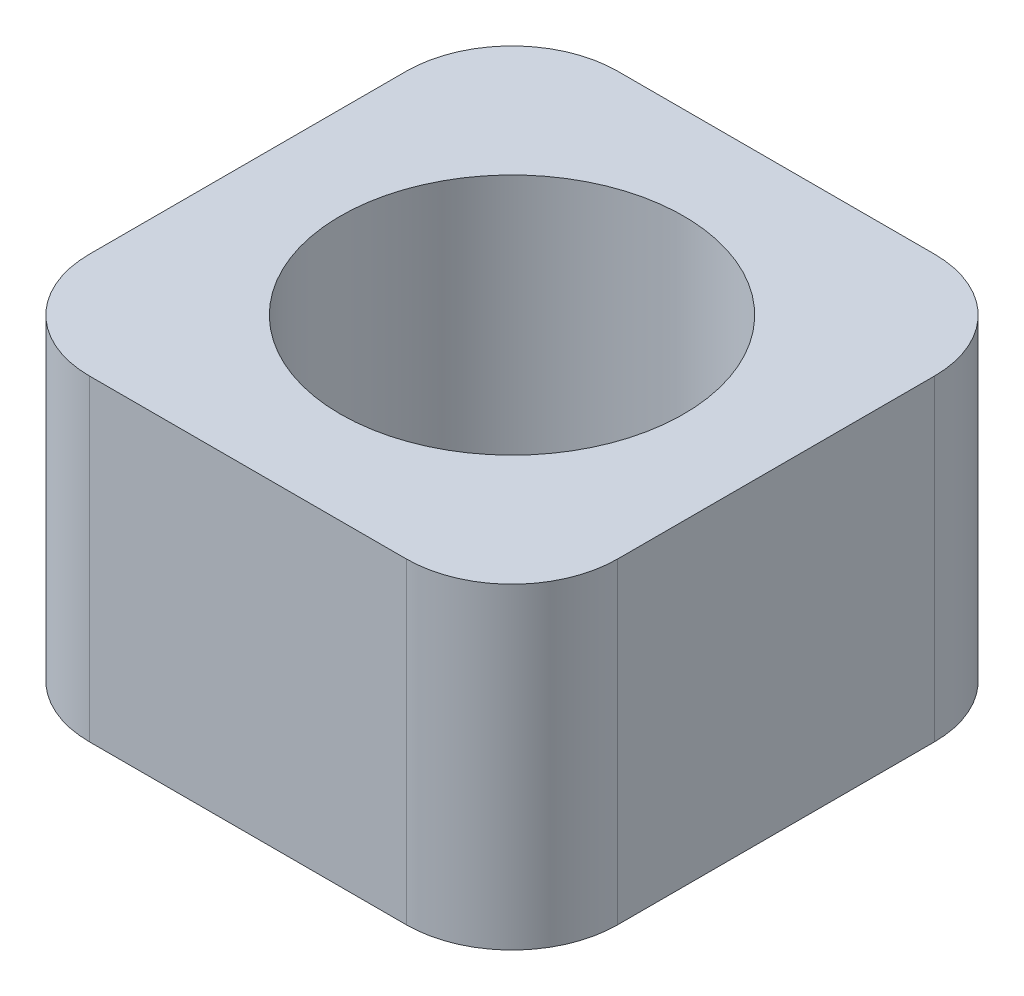
ISO-10303-21;
HEADER;
FILE_DESCRIPTION(('STEP AP214'),'2;1');
FILE_NAME('part.step','',(''),(''),'','','');
FILE_SCHEMA(('AUTOMOTIVE_DESIGN { 1 0 10303 214 1 1 1 1 }'));
ENDSEC;
DATA;
#1=APPLICATION_CONTEXT('core data for automotive mechanical design processes');
#2=APPLICATION_PROTOCOL_DEFINITION('international standard','automotive_design',2000,#1);
#3=PRODUCT_CONTEXT('',#1,'mechanical');
#4=PRODUCT('Part','Part','',(#3));
#5=PRODUCT_RELATED_PRODUCT_CATEGORY('part','',(#4));
#6=PRODUCT_DEFINITION_FORMATION('','',#4);
#7=PRODUCT_DEFINITION_CONTEXT('part definition',#1,'design');
#8=PRODUCT_DEFINITION('design','',#6,#7);
#9=PRODUCT_DEFINITION_SHAPE('','',#8);
#10=(LENGTH_UNIT() NAMED_UNIT(*) SI_UNIT(.MILLI.,.METRE.));
#11=(NAMED_UNIT(*) PLANE_ANGLE_UNIT() SI_UNIT($,.RADIAN.));
#12=(NAMED_UNIT(*) SI_UNIT($,.STERADIAN.) SOLID_ANGLE_UNIT());
#13=UNCERTAINTY_MEASURE_WITH_UNIT(LENGTH_MEASURE(1.E-05),#10,'distance_accuracy_value','');
#14=(GEOMETRIC_REPRESENTATION_CONTEXT(3) GLOBAL_UNCERTAINTY_ASSIGNED_CONTEXT((#13)) GLOBAL_UNIT_ASSIGNED_CONTEXT((#10,
#11,#12)) REPRESENTATION_CONTEXT('',''));
#15=CARTESIAN_POINT('',(0.,0.,0.));
#16=DIRECTION('',(0.,0.,1.));
#17=DIRECTION('',(1.,0.,0.));
#18=AXIS2_PLACEMENT_3D('',#15,#16,#17);
#19=CARTESIAN_POINT('',(-5.,3.,0.));
#20=DIRECTION('',(-1.,0.,0.));
#21=DIRECTION('',(0.,0.,1.));
#22=AXIS2_PLACEMENT_3D('',#19,#20,#21);
#23=PLANE('',#22);
#24=DIRECTION('',(0.,0.,-1.));
#25=VECTOR('',#24,1.);
#26=CARTESIAN_POINT('',(-5.,-3.,0.));
#27=LINE('',#26,#25);
#28=CARTESIAN_POINT('',(-5.,-3.,3.));
#29=VERTEX_POINT('',#28);
#30=CARTESIAN_POINT('',(-5.,-3.,-3.));
#31=VERTEX_POINT('',#30);
#32=EDGE_CURVE('E111',#29,#31,#27,.T.);
#33=ORIENTED_EDGE('',*,*,#32,.F.);
#34=DIRECTION('',(0.,-1.,0.));
#35=VECTOR('',#34,1.);
#36=CARTESIAN_POINT('',(-5.,3.,3.));
#37=LINE('',#36,#35);
#38=CARTESIAN_POINT('',(-5.,3.,3.));
#39=VERTEX_POINT('',#38);
#40=EDGE_CURVE('E11',#29,#39,#37,.F.);
#41=ORIENTED_EDGE('',*,*,#40,.T.);
#42=DIRECTION('',(0.,0.,-1.));
#43=VECTOR('',#42,1.);
#44=CARTESIAN_POINT('',(-5.,3.,0.));
#45=LINE('',#44,#43);
#46=CARTESIAN_POINT('',(-5.,3.,-3.));
#47=VERTEX_POINT('',#46);
#48=EDGE_CURVE('E161',#39,#47,#45,.T.);
#49=ORIENTED_EDGE('',*,*,#48,.T.);
#50=DIRECTION('',(0.,-1.,0.));
#51=VECTOR('',#50,1.);
#52=CARTESIAN_POINT('',(-5.,3.,-3.));
#53=LINE('',#52,#51);
#54=EDGE_CURVE('E47',#47,#31,#53,.T.);
#55=ORIENTED_EDGE('',*,*,#54,.T.);
#56=EDGE_LOOP('',(#33,#41,#49,#55));
#57=FACE_BOUND('',#56,.T.);
#58=ADVANCED_FACE('F39',(#57),#23,.T.);
#59=CARTESIAN_POINT('',(0.,3.,5.));
#60=DIRECTION('',(0.,0.,-1.));
#61=DIRECTION('',(-1.,0.,0.));
#62=AXIS2_PLACEMENT_3D('',#59,#60,#61);
#63=PLANE('',#62);
#64=DIRECTION('',(1.,0.,0.));
#65=VECTOR('',#64,1.);
#66=CARTESIAN_POINT('',(0.,-3.,5.));
#67=LINE('',#66,#65);
#68=CARTESIAN_POINT('',(-3.,-3.,5.));
#69=VERTEX_POINT('',#68);
#70=CARTESIAN_POINT('',(3.,-3.,5.));
#71=VERTEX_POINT('',#70);
#72=EDGE_CURVE('E172',#69,#71,#67,.T.);
#73=ORIENTED_EDGE('',*,*,#72,.T.);
#74=DIRECTION('',(0.,-1.,0.));
#75=VECTOR('',#74,1.);
#76=CARTESIAN_POINT('',(3.,3.,5.));
#77=LINE('',#76,#75);
#78=CARTESIAN_POINT('',(3.,3.,5.));
#79=VERTEX_POINT('',#78);
#80=EDGE_CURVE('E54',#71,#79,#77,.F.);
#81=ORIENTED_EDGE('',*,*,#80,.T.);
#82=DIRECTION('',(1.,0.,0.));
#83=VECTOR('',#82,1.);
#84=CARTESIAN_POINT('',(0.,3.,5.));
#85=LINE('',#84,#83);
#86=CARTESIAN_POINT('',(-3.,3.,5.));
#87=VERTEX_POINT('',#86);
#88=EDGE_CURVE('E162',#87,#79,#85,.T.);
#89=ORIENTED_EDGE('',*,*,#88,.F.);
#90=DIRECTION('',(0.,-1.,0.));
#91=VECTOR('',#90,1.);
#92=CARTESIAN_POINT('',(-3.,-3.,5.));
#93=LINE('',#92,#91);
#94=EDGE_CURVE('E155',#87,#69,#93,.T.);
#95=ORIENTED_EDGE('',*,*,#94,.T.);
#96=EDGE_LOOP('',(#73,#81,#89,#95));
#97=FACE_BOUND('',#96,.T.);
#98=ADVANCED_FACE('F190',(#97),#63,.F.);
#99=CARTESIAN_POINT('',(5.,3.,0.));
#100=DIRECTION('',(-1.,0.,0.));
#101=DIRECTION('',(0.,0.,1.));
#102=AXIS2_PLACEMENT_3D('',#99,#100,#101);
#103=PLANE('',#102);
#104=DIRECTION('',(0.,0.,-1.));
#105=VECTOR('',#104,1.);
#106=CARTESIAN_POINT('',(5.,-3.,0.));
#107=LINE('',#106,#105);
#108=CARTESIAN_POINT('',(5.,-3.,3.));
#109=VERTEX_POINT('',#108);
#110=CARTESIAN_POINT('',(5.,-3.,-3.));
#111=VERTEX_POINT('',#110);
#112=EDGE_CURVE('E127',#109,#111,#107,.T.);
#113=ORIENTED_EDGE('',*,*,#112,.T.);
#114=DIRECTION('',(0.,-1.,0.));
#115=VECTOR('',#114,1.);
#116=CARTESIAN_POINT('',(5.,3.,-3.));
#117=LINE('',#116,#115);
#118=CARTESIAN_POINT('',(5.,3.,-3.));
#119=VERTEX_POINT('',#118);
#120=EDGE_CURVE('E147',#111,#119,#117,.F.);
#121=ORIENTED_EDGE('',*,*,#120,.T.);
#122=DIRECTION('',(0.,0.,-1.));
#123=VECTOR('',#122,1.);
#124=CARTESIAN_POINT('',(5.,3.,0.));
#125=LINE('',#124,#123);
#126=CARTESIAN_POINT('',(5.,3.,3.));
#127=VERTEX_POINT('',#126);
#128=EDGE_CURVE('E164',#127,#119,#125,.T.);
#129=ORIENTED_EDGE('',*,*,#128,.F.);
#130=DIRECTION('',(0.,-1.,0.));
#131=VECTOR('',#130,1.);
#132=CARTESIAN_POINT('',(5.,3.,3.));
#133=LINE('',#132,#131);
#134=EDGE_CURVE('E144',#127,#109,#133,.T.);
#135=ORIENTED_EDGE('',*,*,#134,.T.);
#136=EDGE_LOOP('',(#113,#121,#129,#135));
#137=FACE_BOUND('',#136,.T.);
#138=ADVANCED_FACE('F178',(#137),#103,.F.);
#139=CARTESIAN_POINT('',(0.,3.,-5.));
#140=DIRECTION('',(0.,0.,-1.));
#141=DIRECTION('',(-1.,0.,0.));
#142=AXIS2_PLACEMENT_3D('',#139,#140,#141);
#143=PLANE('',#142);
#144=DIRECTION('',(1.,0.,0.));
#145=VECTOR('',#144,1.);
#146=CARTESIAN_POINT('',(0.,3.,-5.));
#147=LINE('',#146,#145);
#148=CARTESIAN_POINT('',(-3.,3.,-5.));
#149=VERTEX_POINT('',#148);
#150=CARTESIAN_POINT('',(3.,3.,-5.));
#151=VERTEX_POINT('',#150);
#152=EDGE_CURVE('E135',#149,#151,#147,.T.);
#153=ORIENTED_EDGE('',*,*,#152,.T.);
#154=DIRECTION('',(0.,-1.,0.));
#155=VECTOR('',#154,1.);
#156=CARTESIAN_POINT('',(3.,-3.,-5.));
#157=LINE('',#156,#155);
#158=CARTESIAN_POINT('',(3.,-3.,-5.));
#159=VERTEX_POINT('',#158);
#160=EDGE_CURVE('E117',#151,#159,#157,.T.);
#161=ORIENTED_EDGE('',*,*,#160,.T.);
#162=DIRECTION('',(1.,0.,0.));
#163=VECTOR('',#162,1.);
#164=CARTESIAN_POINT('',(0.,-3.,-5.));
#165=LINE('',#164,#163);
#166=CARTESIAN_POINT('',(-3.,-3.,-5.));
#167=VERTEX_POINT('',#166);
#168=EDGE_CURVE('E109',#167,#159,#165,.T.);
#169=ORIENTED_EDGE('',*,*,#168,.F.);
#170=DIRECTION('',(0.,-1.,0.));
#171=VECTOR('',#170,1.);
#172=CARTESIAN_POINT('',(-3.,3.,-5.));
#173=LINE('',#172,#171);
#174=EDGE_CURVE('E123',#167,#149,#173,.F.);
#175=ORIENTED_EDGE('',*,*,#174,.T.);
#176=EDGE_LOOP('',(#153,#161,#169,#175));
#177=FACE_BOUND('',#176,.T.);
#178=ADVANCED_FACE('F122',(#177),#143,.T.);
#179=CARTESIAN_POINT('',(0.,3.,0.));
#180=DIRECTION('',(0.,-1.,0.));
#181=DIRECTION('',(0.,0.,-1.));
#182=AXIS2_PLACEMENT_3D('',#179,#180,#181);
#183=CYLINDRICAL_SURFACE('',#182,3.25);
#184=CARTESIAN_POINT('',(0.,3.,0.));
#185=DIRECTION('',(0.,1.,0.));
#186=DIRECTION('',(0.,0.,1.));
#187=AXIS2_PLACEMENT_3D('',#184,#185,#186);
#188=CIRCLE('',#187,3.25);
#189=CARTESIAN_POINT('',(0.,3.,3.25));
#190=VERTEX_POINT('',#189);
#191=EDGE_CURVE('E131',#190,#190,#188,.T.);
#192=ORIENTED_EDGE('',*,*,#191,.T.);
#193=EDGE_LOOP('',(#192));
#194=FACE_BOUND('',#193,.T.);
#195=CARTESIAN_POINT('',(0.,-3.,0.));
#196=DIRECTION('',(0.,1.,0.));
#197=DIRECTION('',(0.,0.,1.));
#198=AXIS2_PLACEMENT_3D('',#195,#196,#197);
#199=CIRCLE('',#198,3.25);
#200=CARTESIAN_POINT('',(0.,-3.,3.25));
#201=VERTEX_POINT('',#200);
#202=EDGE_CURVE('E126',#201,#201,#199,.T.);
#203=ORIENTED_EDGE('',*,*,#202,.F.);
#204=EDGE_LOOP('',(#203));
#205=FACE_BOUND('',#204,.T.);
#206=ADVANCED_FACE('F217',(#194,#205),#183,.F.);
#207=CARTESIAN_POINT('',(0.,3.,0.));
#208=DIRECTION('',(0.,1.,0.));
#209=DIRECTION('',(0.,0.,1.));
#210=AXIS2_PLACEMENT_3D('',#207,#208,#209);
#211=PLANE('',#210);
#212=ORIENTED_EDGE('',*,*,#128,.T.);
#213=CARTESIAN_POINT('',(3.,3.,-3.));
#214=DIRECTION('',(0.,1.,0.));
#215=DIRECTION('',(0.,0.,1.));
#216=AXIS2_PLACEMENT_3D('',#213,#214,#215);
#217=CIRCLE('',#216,2.);
#218=EDGE_CURVE('E153',#119,#151,#217,.T.);
#219=ORIENTED_EDGE('',*,*,#218,.T.);
#220=ORIENTED_EDGE('',*,*,#152,.F.);
#221=CARTESIAN_POINT('',(-3.,3.,-3.));
#222=DIRECTION('',(0.,1.,0.));
#223=DIRECTION('',(0.,0.,1.));
#224=AXIS2_PLACEMENT_3D('',#221,#222,#223);
#225=CIRCLE('',#224,2.);
#226=EDGE_CURVE('E130',#149,#47,#225,.T.);
#227=ORIENTED_EDGE('',*,*,#226,.T.);
#228=ORIENTED_EDGE('',*,*,#48,.F.);
#229=CARTESIAN_POINT('',(-3.,3.,3.));
#230=DIRECTION('',(0.,1.,0.));
#231=DIRECTION('',(0.,0.,1.));
#232=AXIS2_PLACEMENT_3D('',#229,#230,#231);
#233=CIRCLE('',#232,2.);
#234=EDGE_CURVE('E61',#39,#87,#233,.T.);
#235=ORIENTED_EDGE('',*,*,#234,.T.);
#236=ORIENTED_EDGE('',*,*,#88,.T.);
#237=CARTESIAN_POINT('',(3.,3.,3.));
#238=DIRECTION('',(0.,1.,0.));
#239=DIRECTION('',(0.,0.,1.));
#240=AXIS2_PLACEMENT_3D('',#237,#238,#239);
#241=CIRCLE('',#240,2.);
#242=EDGE_CURVE('E151',#79,#127,#241,.T.);
#243=ORIENTED_EDGE('',*,*,#242,.T.);
#244=EDGE_LOOP('',(#212,#219,#220,#227,#228,#235,#236,#243));
#245=FACE_BOUND('',#244,.T.);
#246=ORIENTED_EDGE('',*,*,#191,.F.);
#247=EDGE_LOOP('',(#246));
#248=FACE_BOUND('',#247,.T.);
#249=ADVANCED_FACE('F184',(#245,#248),#211,.T.);
#250=CARTESIAN_POINT('',(0.,-3.,0.));
#251=DIRECTION('',(0.,1.,0.));
#252=DIRECTION('',(0.,0.,1.));
#253=AXIS2_PLACEMENT_3D('',#250,#251,#252);
#254=PLANE('',#253);
#255=ORIENTED_EDGE('',*,*,#168,.T.);
#256=CARTESIAN_POINT('',(3.,-3.,-3.));
#257=DIRECTION('',(0.,1.,0.));
#258=DIRECTION('',(0.,0.,1.));
#259=AXIS2_PLACEMENT_3D('',#256,#257,#258);
#260=CIRCLE('',#259,2.);
#261=EDGE_CURVE('E142',#159,#111,#260,.F.);
#262=ORIENTED_EDGE('',*,*,#261,.T.);
#263=ORIENTED_EDGE('',*,*,#112,.F.);
#264=CARTESIAN_POINT('',(3.,-3.,3.));
#265=DIRECTION('',(0.,1.,0.));
#266=DIRECTION('',(0.,0.,1.));
#267=AXIS2_PLACEMENT_3D('',#264,#265,#266);
#268=CIRCLE('',#267,2.);
#269=EDGE_CURVE('E140',#109,#71,#268,.F.);
#270=ORIENTED_EDGE('',*,*,#269,.T.);
#271=ORIENTED_EDGE('',*,*,#72,.F.);
#272=CARTESIAN_POINT('',(-3.,-3.,3.));
#273=DIRECTION('',(0.,1.,0.));
#274=DIRECTION('',(0.,0.,1.));
#275=AXIS2_PLACEMENT_3D('',#272,#273,#274);
#276=CIRCLE('',#275,2.);
#277=EDGE_CURVE('E116',#69,#29,#276,.F.);
#278=ORIENTED_EDGE('',*,*,#277,.T.);
#279=ORIENTED_EDGE('',*,*,#32,.T.);
#280=CARTESIAN_POINT('',(-3.,-3.,-3.));
#281=DIRECTION('',(0.,1.,0.));
#282=DIRECTION('',(0.,0.,1.));
#283=AXIS2_PLACEMENT_3D('',#280,#281,#282);
#284=CIRCLE('',#283,2.);
#285=EDGE_CURVE('E105',#31,#167,#284,.F.);
#286=ORIENTED_EDGE('',*,*,#285,.T.);
#287=EDGE_LOOP('',(#255,#262,#263,#270,#271,#278,#279,#286));
#288=FACE_BOUND('',#287,.T.);
#289=ORIENTED_EDGE('',*,*,#202,.T.);
#290=EDGE_LOOP('',(#289));
#291=FACE_BOUND('',#290,.T.);
#292=ADVANCED_FACE('F107',(#288,#291),#254,.F.);
#293=CARTESIAN_POINT('',(3.,3.,-3.));
#294=DIRECTION('',(0.,1.,0.));
#295=DIRECTION('',(0.,0.,1.));
#296=AXIS2_PLACEMENT_3D('',#293,#294,#295);
#297=CYLINDRICAL_SURFACE('',#296,2.);
#298=ORIENTED_EDGE('',*,*,#218,.F.);
#299=ORIENTED_EDGE('',*,*,#120,.F.);
#300=ORIENTED_EDGE('',*,*,#261,.F.);
#301=ORIENTED_EDGE('',*,*,#160,.F.);
#302=EDGE_LOOP('',(#298,#299,#300,#301));
#303=FACE_BOUND('',#302,.T.);
#304=ADVANCED_FACE('F183',(#303),#297,.T.);
#305=CARTESIAN_POINT('',(3.,3.,3.));
#306=DIRECTION('',(0.,-1.,0.));
#307=DIRECTION('',(0.,0.,-1.));
#308=AXIS2_PLACEMENT_3D('',#305,#306,#307);
#309=CYLINDRICAL_SURFACE('',#308,2.);
#310=ORIENTED_EDGE('',*,*,#242,.F.);
#311=ORIENTED_EDGE('',*,*,#80,.F.);
#312=ORIENTED_EDGE('',*,*,#269,.F.);
#313=ORIENTED_EDGE('',*,*,#134,.F.);
#314=EDGE_LOOP('',(#310,#311,#312,#313));
#315=FACE_BOUND('',#314,.T.);
#316=ADVANCED_FACE('F188',(#315),#309,.T.);
#317=CARTESIAN_POINT('',(-3.,3.,3.));
#318=DIRECTION('',(0.,1.,0.));
#319=DIRECTION('',(0.,0.,1.));
#320=AXIS2_PLACEMENT_3D('',#317,#318,#319);
#321=CYLINDRICAL_SURFACE('',#320,2.);
#322=ORIENTED_EDGE('',*,*,#234,.F.);
#323=ORIENTED_EDGE('',*,*,#40,.F.);
#324=ORIENTED_EDGE('',*,*,#277,.F.);
#325=ORIENTED_EDGE('',*,*,#94,.F.);
#326=EDGE_LOOP('',(#322,#323,#324,#325));
#327=FACE_BOUND('',#326,.T.);
#328=ADVANCED_FACE('F193',(#327),#321,.T.);
#329=CARTESIAN_POINT('',(-3.,3.,-3.));
#330=DIRECTION('',(0.,-1.,0.));
#331=DIRECTION('',(0.,0.,-1.));
#332=AXIS2_PLACEMENT_3D('',#329,#330,#331);
#333=CYLINDRICAL_SURFACE('',#332,2.);
#334=ORIENTED_EDGE('',*,*,#226,.F.);
#335=ORIENTED_EDGE('',*,*,#174,.F.);
#336=ORIENTED_EDGE('',*,*,#285,.F.);
#337=ORIENTED_EDGE('',*,*,#54,.F.);
#338=EDGE_LOOP('',(#334,#335,#336,#337));
#339=FACE_BOUND('',#338,.T.);
#340=ADVANCED_FACE('F41',(#339),#333,.T.);
#341=CLOSED_SHELL('',(#58,#98,#138,#178,#206,#249,#292,#304,#316,#328,#340));
#342=MANIFOLD_SOLID_BREP('B2',#341);
#343=ADVANCED_BREP_SHAPE_REPRESENTATION('',(#18,#342),#14);
#344=SHAPE_DEFINITION_REPRESENTATION(#9,#343);
ENDSEC;
END-ISO-10303-21;
